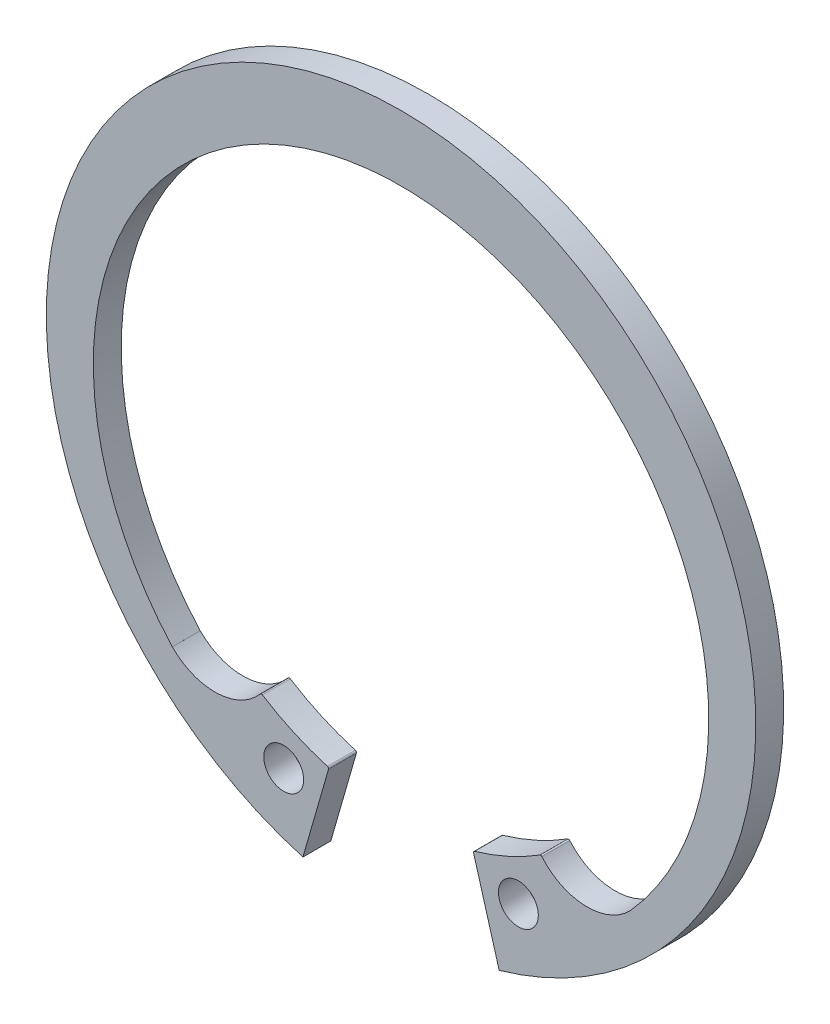
ISO-10303-21;
HEADER;
FILE_DESCRIPTION(('STEP AP214'),'2;1');
FILE_NAME('part.step','',(''),(''),'','','');
FILE_SCHEMA(('AUTOMOTIVE_DESIGN { 1 0 10303 214 1 1 1 1 }'));
ENDSEC;
DATA;
#1=APPLICATION_CONTEXT('core data for automotive mechanical design processes');
#2=APPLICATION_PROTOCOL_DEFINITION('international standard','automotive_design',2000,#1);
#3=PRODUCT_CONTEXT('',#1,'mechanical');
#4=PRODUCT('Part','Part','',(#3));
#5=PRODUCT_RELATED_PRODUCT_CATEGORY('part','',(#4));
#6=PRODUCT_DEFINITION_FORMATION('','',#4);
#7=PRODUCT_DEFINITION_CONTEXT('part definition',#1,'design');
#8=PRODUCT_DEFINITION('design','',#6,#7);
#9=PRODUCT_DEFINITION_SHAPE('','',#8);
#10=(LENGTH_UNIT() NAMED_UNIT(*) SI_UNIT(.MILLI.,.METRE.));
#11=(NAMED_UNIT(*) PLANE_ANGLE_UNIT() SI_UNIT($,.RADIAN.));
#12=(NAMED_UNIT(*) SI_UNIT($,.STERADIAN.) SOLID_ANGLE_UNIT());
#13=UNCERTAINTY_MEASURE_WITH_UNIT(LENGTH_MEASURE(1.E-05),#10,'distance_accuracy_value','');
#14=(GEOMETRIC_REPRESENTATION_CONTEXT(3) GLOBAL_UNCERTAINTY_ASSIGNED_CONTEXT((#13)) GLOBAL_UNIT_ASSIGNED_CONTEXT((#10,
#11,#12)) REPRESENTATION_CONTEXT('',''));
#15=CARTESIAN_POINT('',(0.,0.,0.));
#16=DIRECTION('',(0.,0.,1.));
#17=DIRECTION('',(1.,0.,0.));
#18=AXIS2_PLACEMENT_3D('',#15,#16,#17);
#19=CARTESIAN_POINT('',(0.,0.,-1.75));
#20=DIRECTION('',(0.,0.,1.));
#21=DIRECTION('',(1.,0.,0.));
#22=AXIS2_PLACEMENT_3D('',#19,#20,#21);
#23=CYLINDRICAL_SURFACE('',#22,22.25);
#24=CARTESIAN_POINT('',(0.,0.,-1.75));
#25=DIRECTION('',(0.,0.,1.));
#26=DIRECTION('',(1.,0.,0.));
#27=AXIS2_PLACEMENT_3D('',#24,#25,#26);
#28=CIRCLE('',#27,22.25);
#29=CARTESIAN_POINT('',(6.15473831044329,-21.3818076020238,-1.75));
#30=VERTEX_POINT('',#29);
#31=CARTESIAN_POINT('',(-6.15473831044329,-21.3818076020238,-1.75));
#32=VERTEX_POINT('',#31);
#33=EDGE_CURVE('E147',#30,#32,#28,.T.);
#34=ORIENTED_EDGE('',*,*,#33,.T.);
#35=DIRECTION('',(0.,0.,1.));
#36=VECTOR('',#35,1.);
#37=CARTESIAN_POINT('',(-6.15473831044329,-21.3818076020238,-1.75));
#38=LINE('',#37,#36);
#39=CARTESIAN_POINT('',(-6.15473831044329,-21.3818076020238,0.));
#40=VERTEX_POINT('',#39);
#41=EDGE_CURVE('E37',#32,#40,#38,.T.);
#42=ORIENTED_EDGE('',*,*,#41,.T.);
#43=CARTESIAN_POINT('',(0.,0.,0.));
#44=DIRECTION('',(0.,0.,1.));
#45=DIRECTION('',(1.,0.,0.));
#46=AXIS2_PLACEMENT_3D('',#43,#44,#45);
#47=CIRCLE('',#46,22.25);
#48=CARTESIAN_POINT('',(6.15473831044329,-21.3818076020238,0.));
#49=VERTEX_POINT('',#48);
#50=EDGE_CURVE('E58',#49,#40,#47,.T.);
#51=ORIENTED_EDGE('',*,*,#50,.F.);
#52=DIRECTION('',(0.,0.,1.));
#53=VECTOR('',#52,1.);
#54=CARTESIAN_POINT('',(6.15473831044329,-21.3818076020238,-1.75));
#55=LINE('',#54,#53);
#56=EDGE_CURVE('E11',#30,#49,#55,.T.);
#57=ORIENTED_EDGE('',*,*,#56,.F.);
#58=EDGE_LOOP('',(#34,#42,#51,#57));
#59=FACE_BOUND('',#58,.T.);
#60=ADVANCED_FACE('F34',(#59),#23,.T.);
#61=CARTESIAN_POINT('',(6.15473831044329,-21.3818076020238,-1.75));
#62=DIRECTION('',(-0.960980116944889,-0.276617452154753,0.));
#63=DIRECTION('',(0.276617452154753,-0.960980116944889,0.));
#64=AXIS2_PLACEMENT_3D('',#61,#62,#63);
#65=PLANE('',#64);
#66=DIRECTION('',(0.276617452154753,-0.960980116944889,0.));
#67=VECTOR('',#66,1.);
#68=CARTESIAN_POINT('',(6.15473831044329,-21.3818076020238,0.));
#69=LINE('',#68,#67);
#70=CARTESIAN_POINT('',(4.55027300891599,-15.8078308298239,0.));
#71=VERTEX_POINT('',#70);
#72=EDGE_CURVE('E250',#71,#49,#69,.T.);
#73=ORIENTED_EDGE('',*,*,#72,.F.);
#74=DIRECTION('',(0.,0.,1.));
#75=VECTOR('',#74,1.);
#76=CARTESIAN_POINT('',(4.55027300891599,-15.8078308298239,-1.75));
#77=LINE('',#76,#75);
#78=CARTESIAN_POINT('',(4.55027300891599,-15.8078308298239,-1.75));
#79=VERTEX_POINT('',#78);
#80=EDGE_CURVE('E223',#79,#71,#77,.T.);
#81=ORIENTED_EDGE('',*,*,#80,.F.);
#82=DIRECTION('',(0.276617452154753,-0.960980116944889,0.));
#83=VECTOR('',#82,1.);
#84=CARTESIAN_POINT('',(6.15473831044329,-21.3818076020238,-1.75));
#85=LINE('',#84,#83);
#86=EDGE_CURVE('E253',#79,#30,#85,.T.);
#87=ORIENTED_EDGE('',*,*,#86,.T.);
#88=ORIENTED_EDGE('',*,*,#56,.T.);
#89=EDGE_LOOP('',(#73,#81,#87,#88));
#90=FACE_BOUND('',#89,.T.);
#91=ADVANCED_FACE('F266',(#90),#65,.T.);
#92=CARTESIAN_POINT('',(0.,-1.15100936737794,-1.75));
#93=DIRECTION('',(0.,0.,1.));
#94=DIRECTION('',(1.,0.,0.));
#95=AXIS2_PLACEMENT_3D('',#92,#93,#94);
#96=CYLINDRICAL_SURFACE('',#95,19.3010093673779);
#97=DIRECTION('',(0.,0.,1.));
#98=VECTOR('',#97,1.);
#99=CARTESIAN_POINT('',(-14.348142605322,-14.0606866048984,-1.75));
#100=LINE('',#99,#98);
#101=CARTESIAN_POINT('',(-14.348142605322,-14.0606866048984,-1.75));
#102=VERTEX_POINT('',#101);
#103=CARTESIAN_POINT('',(-14.348142605322,-14.0606866048984,0.));
#104=VERTEX_POINT('',#103);
#105=EDGE_CURVE('E188',#102,#104,#100,.T.);
#106=ORIENTED_EDGE('',*,*,#105,.F.);
#107=CARTESIAN_POINT('',(0.,-1.15100936737794,-1.75));
#108=DIRECTION('',(0.,0.,-1.));
#109=DIRECTION('',(1.,0.,0.));
#110=AXIS2_PLACEMENT_3D('',#107,#108,#109);
#111=CIRCLE('',#110,19.3010093673779);
#112=CARTESIAN_POINT('',(14.348142605322,-14.0606866048984,-1.75));
#113=VERTEX_POINT('',#112);
#114=EDGE_CURVE('E66',#102,#113,#111,.T.);
#115=ORIENTED_EDGE('',*,*,#114,.T.);
#116=DIRECTION('',(0.,0.,1.));
#117=VECTOR('',#116,1.);
#118=CARTESIAN_POINT('',(14.348142605322,-14.0606866048984,-1.75));
#119=LINE('',#118,#117);
#120=CARTESIAN_POINT('',(14.348142605322,-14.0606866048984,0.));
#121=VERTEX_POINT('',#120);
#122=EDGE_CURVE('E226',#121,#113,#119,.F.);
#123=ORIENTED_EDGE('',*,*,#122,.F.);
#124=CARTESIAN_POINT('',(0.,-1.15100936737794,0.));
#125=DIRECTION('',(0.,0.,-1.));
#126=DIRECTION('',(1.,0.,0.));
#127=AXIS2_PLACEMENT_3D('',#124,#125,#126);
#128=CIRCLE('',#127,19.3010093673779);
#129=EDGE_CURVE('E259',#104,#121,#128,.T.);
#130=ORIENTED_EDGE('',*,*,#129,.F.);
#131=EDGE_LOOP('',(#106,#115,#123,#130));
#132=FACE_BOUND('',#131,.T.);
#133=ADVANCED_FACE('F288',(#132),#96,.F.);
#134=CARTESIAN_POINT('',(-6.15473831044329,-21.3818076020238,-1.75));
#135=DIRECTION('',(0.960980116944889,-0.276617452154754,0.));
#136=DIRECTION('',(0.276617452154754,0.960980116944889,0.));
#137=AXIS2_PLACEMENT_3D('',#134,#135,#136);
#138=PLANE('',#137);
#139=DIRECTION('',(0.276617452154754,0.960980116944889,0.));
#140=VECTOR('',#139,1.);
#141=CARTESIAN_POINT('',(-6.15473831044329,-21.3818076020238,0.));
#142=LINE('',#141,#140);
#143=CARTESIAN_POINT('',(-4.55027300891599,-15.8078308298239,0.));
#144=VERTEX_POINT('',#143);
#145=EDGE_CURVE('E257',#40,#144,#142,.T.);
#146=ORIENTED_EDGE('',*,*,#145,.F.);
#147=ORIENTED_EDGE('',*,*,#41,.F.);
#148=DIRECTION('',(0.276617452154754,0.960980116944889,0.));
#149=VECTOR('',#148,1.);
#150=CARTESIAN_POINT('',(-6.15473831044329,-21.3818076020238,-1.75));
#151=LINE('',#150,#149);
#152=CARTESIAN_POINT('',(-4.55027300891599,-15.8078308298239,-1.75));
#153=VERTEX_POINT('',#152);
#154=EDGE_CURVE('E139',#32,#153,#151,.T.);
#155=ORIENTED_EDGE('',*,*,#154,.T.);
#156=DIRECTION('',(0.,0.,1.));
#157=VECTOR('',#156,1.);
#158=CARTESIAN_POINT('',(-4.55027300891599,-15.8078308298239,-1.75));
#159=LINE('',#158,#157);
#160=EDGE_CURVE('E143',#153,#144,#159,.T.);
#161=ORIENTED_EDGE('',*,*,#160,.T.);
#162=EDGE_LOOP('',(#146,#147,#155,#161));
#163=FACE_BOUND('',#162,.T.);
#164=ADVANCED_FACE('F142',(#163),#138,.T.);
#165=CARTESIAN_POINT('',(0.,0.,-1.75));
#166=DIRECTION('',(0.,0.,1.));
#167=DIRECTION('',(1.,0.,0.));
#168=AXIS2_PLACEMENT_3D('',#165,#166,#167);
#169=PLANE('',#168);
#170=ORIENTED_EDGE('',*,*,#114,.F.);
#171=DIRECTION('',(-0.714225110552972,-0.699916060292657,0.));
#172=VECTOR('',#171,1.);
#173=CARTESIAN_POINT('',(-15.8915087098036,-15.5731323415116,-1.75));
#174=LINE('',#173,#172);
#175=CARTESIAN_POINT('',(-14.3451372472455,-14.057741457278,-1.75));
#176=VERTEX_POINT('',#175);
#177=EDGE_CURVE('E157',#176,#102,#174,.T.);
#178=ORIENTED_EDGE('',*,*,#177,.F.);
#179=CARTESIAN_POINT('',(-11.6775805575411,-11.4436275857849,-1.75));
#180=DIRECTION('',(0.,0.,-1.));
#181=DIRECTION('',(1.,0.,0.));
#182=AXIS2_PLACEMENT_3D('',#179,#180,#181);
#183=CIRCLE('',#182,3.73489625370228);
#184=CARTESIAN_POINT('',(-8.83127616096118,-13.8618916962429,-1.75));
#185=VERTEX_POINT('',#184);
#186=EDGE_CURVE('E174',#185,#176,#183,.T.);
#187=ORIENTED_EDGE('',*,*,#186,.F.);
#188=CARTESIAN_POINT('',(-8.75506776845875,-13.9266395217832,-1.75));
#189=DIRECTION('',(0.,0.,1.));
#190=DIRECTION('',(1.,0.,0.));
#191=AXIS2_PLACEMENT_3D('',#188,#189,#190);
#192=CIRCLE('',#191,0.0999999999999999);
#193=CARTESIAN_POINT('',(-8.70184547199396,-13.8419790991584,-1.75));
#194=VERTEX_POINT('',#193);
#195=EDGE_CURVE('E166',#194,#185,#192,.T.);
#196=ORIENTED_EDGE('',*,*,#195,.F.);
#197=CARTESIAN_POINT('',(0.,0.,-1.75));
#198=DIRECTION('',(0.,0.,-1.));
#199=DIRECTION('',(1.,0.,0.));
#200=AXIS2_PLACEMENT_3D('',#197,#198,#199);
#201=CIRCLE('',#200,16.35);
#202=CARTESIAN_POINT('',(-4.61812560407182,-15.6842410050667,-1.75));
#203=VERTEX_POINT('',#202);
#204=EDGE_CURVE('E162',#203,#194,#201,.T.);
#205=ORIENTED_EDGE('',*,*,#204,.F.);
#206=CARTESIAN_POINT('',(-4.64637102061048,-15.7801690846084,-1.75));
#207=DIRECTION('',(0.,0.,1.));
#208=DIRECTION('',(-1.,0.,0.));
#209=AXIS2_PLACEMENT_3D('',#206,#207,#208);
#210=CIRCLE('',#209,0.0999999999999955);
#211=EDGE_CURVE('E153',#153,#203,#210,.T.);
#212=ORIENTED_EDGE('',*,*,#211,.F.);
#213=ORIENTED_EDGE('',*,*,#154,.F.);
#214=ORIENTED_EDGE('',*,*,#33,.F.);
#215=ORIENTED_EDGE('',*,*,#86,.F.);
#216=CARTESIAN_POINT('',(4.64637102061048,-15.7801690846084,-1.75));
#217=DIRECTION('',(0.,0.,1.));
#218=DIRECTION('',(1.,0.,0.));
#219=AXIS2_PLACEMENT_3D('',#216,#217,#218);
#220=CIRCLE('',#219,0.0999999999999972);
#221=CARTESIAN_POINT('',(4.61812560407182,-15.6842410050667,-1.75));
#222=VERTEX_POINT('',#221);
#223=EDGE_CURVE('E208',#222,#79,#220,.T.);
#224=ORIENTED_EDGE('',*,*,#223,.F.);
#225=CARTESIAN_POINT('',(0.,0.,-1.75));
#226=DIRECTION('',(0.,0.,-1.));
#227=DIRECTION('',(1.,0.,0.));
#228=AXIS2_PLACEMENT_3D('',#225,#226,#227);
#229=CIRCLE('',#228,16.35);
#230=CARTESIAN_POINT('',(8.70184547199396,-13.8419790991584,-1.75));
#231=VERTEX_POINT('',#230);
#232=EDGE_CURVE('E206',#231,#222,#229,.T.);
#233=ORIENTED_EDGE('',*,*,#232,.F.);
#234=CARTESIAN_POINT('',(8.75506776845875,-13.9266395217832,-1.75));
#235=DIRECTION('',(0.,0.,1.));
#236=DIRECTION('',(-1.,0.,0.));
#237=AXIS2_PLACEMENT_3D('',#234,#235,#236);
#238=CIRCLE('',#237,0.0999999999999999);
#239=CARTESIAN_POINT('',(8.83127616096118,-13.8618916962429,-1.75));
#240=VERTEX_POINT('',#239);
#241=EDGE_CURVE('E203',#240,#231,#238,.T.);
#242=ORIENTED_EDGE('',*,*,#241,.F.);
#243=CARTESIAN_POINT('',(11.6775805575411,-11.4436275857849,-1.75));
#244=DIRECTION('',(0.,0.,-1.));
#245=DIRECTION('',(1.,0.,0.));
#246=AXIS2_PLACEMENT_3D('',#243,#244,#245);
#247=CIRCLE('',#246,3.73489625370228);
#248=CARTESIAN_POINT('',(14.3451372472455,-14.057741457278,-1.75));
#249=VERTEX_POINT('',#248);
#250=EDGE_CURVE('E199',#249,#240,#247,.T.);
#251=ORIENTED_EDGE('',*,*,#250,.F.);
#252=DIRECTION('',(-0.714225110552972,0.699916060292657,0.));
#253=VECTOR('',#252,1.);
#254=CARTESIAN_POINT('',(14.3451372472455,-14.057741457278,-1.75));
#255=LINE('',#254,#253);
#256=EDGE_CURVE('E197',#113,#249,#255,.T.);
#257=ORIENTED_EDGE('',*,*,#256,.F.);
#258=EDGE_LOOP('',(#170,#178,#187,#196,#205,#212,#213,#214,#215,#224,#233,#242,#251,#257));
#259=FACE_BOUND('',#258,.T.);
#260=CARTESIAN_POINT('',(7.35991880160462,-17.163543347275,-1.75));
#261=DIRECTION('',(0.,0.,1.));
#262=DIRECTION('',(1.,0.,0.));
#263=AXIS2_PLACEMENT_3D('',#260,#261,#262);
#264=CIRCLE('',#263,1.25);
#265=CARTESIAN_POINT('',(8.60991880160462,-17.163543347275,-1.75));
#266=VERTEX_POINT('',#265);
#267=EDGE_CURVE('E245',#266,#266,#264,.T.);
#268=ORIENTED_EDGE('',*,*,#267,.T.);
#269=EDGE_LOOP('',(#268));
#270=FACE_BOUND('',#269,.T.);
#271=CARTESIAN_POINT('',(-7.35991880160461,-17.163543347275,-1.75));
#272=DIRECTION('',(0.,0.,1.));
#273=DIRECTION('',(1.,0.,0.));
#274=AXIS2_PLACEMENT_3D('',#271,#272,#273);
#275=CIRCLE('',#274,1.25);
#276=CARTESIAN_POINT('',(-6.10991880160461,-17.163543347275,-1.75));
#277=VERTEX_POINT('',#276);
#278=EDGE_CURVE('E239',#277,#277,#275,.T.);
#279=ORIENTED_EDGE('',*,*,#278,.T.);
#280=EDGE_LOOP('',(#279));
#281=FACE_BOUND('',#280,.T.);
#282=ADVANCED_FACE('F159',(#259,#270,#281),#169,.F.);
#283=CARTESIAN_POINT('',(0.,0.,0.));
#284=DIRECTION('',(0.,0.,1.));
#285=DIRECTION('',(1.,0.,0.));
#286=AXIS2_PLACEMENT_3D('',#283,#284,#285);
#287=PLANE('',#286);
#288=DIRECTION('',(-0.714225110552972,-0.699916060292657,0.));
#289=VECTOR('',#288,1.);
#290=CARTESIAN_POINT('',(-15.8915087098036,-15.5731323415116,0.));
#291=LINE('',#290,#289);
#292=CARTESIAN_POINT('',(-14.3451372472455,-14.057741457278,0.));
#293=VERTEX_POINT('',#292);
#294=EDGE_CURVE('E164',#293,#104,#291,.T.);
#295=ORIENTED_EDGE('',*,*,#294,.T.);
#296=ORIENTED_EDGE('',*,*,#129,.T.);
#297=DIRECTION('',(-0.714225110552972,0.699916060292657,0.));
#298=VECTOR('',#297,1.);
#299=CARTESIAN_POINT('',(14.3451372472455,-14.057741457278,0.));
#300=LINE('',#299,#298);
#301=CARTESIAN_POINT('',(14.3451372472455,-14.057741457278,0.));
#302=VERTEX_POINT('',#301);
#303=EDGE_CURVE('E196',#121,#302,#300,.T.);
#304=ORIENTED_EDGE('',*,*,#303,.T.);
#305=CARTESIAN_POINT('',(11.6775805575411,-11.4436275857849,0.));
#306=DIRECTION('',(0.,0.,-1.));
#307=DIRECTION('',(1.,0.,0.));
#308=AXIS2_PLACEMENT_3D('',#305,#306,#307);
#309=CIRCLE('',#308,3.73489625370228);
#310=CARTESIAN_POINT('',(8.83127616096118,-13.8618916962429,0.));
#311=VERTEX_POINT('',#310);
#312=EDGE_CURVE('E213',#302,#311,#309,.T.);
#313=ORIENTED_EDGE('',*,*,#312,.T.);
#314=CARTESIAN_POINT('',(8.75506776845875,-13.9266395217832,0.));
#315=DIRECTION('',(0.,0.,1.));
#316=DIRECTION('',(-1.,0.,0.));
#317=AXIS2_PLACEMENT_3D('',#314,#315,#316);
#318=CIRCLE('',#317,0.0999999999999999);
#319=CARTESIAN_POINT('',(8.70184547199396,-13.8419790991584,0.));
#320=VERTEX_POINT('',#319);
#321=EDGE_CURVE('E216',#311,#320,#318,.T.);
#322=ORIENTED_EDGE('',*,*,#321,.T.);
#323=CARTESIAN_POINT('',(0.,0.,0.));
#324=DIRECTION('',(0.,0.,-1.));
#325=DIRECTION('',(1.,0.,0.));
#326=AXIS2_PLACEMENT_3D('',#323,#324,#325);
#327=CIRCLE('',#326,16.35);
#328=CARTESIAN_POINT('',(4.61812560407182,-15.6842410050667,0.));
#329=VERTEX_POINT('',#328);
#330=EDGE_CURVE('E219',#320,#329,#327,.T.);
#331=ORIENTED_EDGE('',*,*,#330,.T.);
#332=CARTESIAN_POINT('',(4.64637102061048,-15.7801690846084,0.));
#333=DIRECTION('',(0.,0.,1.));
#334=DIRECTION('',(1.,0.,0.));
#335=AXIS2_PLACEMENT_3D('',#332,#333,#334);
#336=CIRCLE('',#335,0.0999999999999972);
#337=EDGE_CURVE('E200',#329,#71,#336,.T.);
#338=ORIENTED_EDGE('',*,*,#337,.T.);
#339=ORIENTED_EDGE('',*,*,#72,.T.);
#340=ORIENTED_EDGE('',*,*,#50,.T.);
#341=ORIENTED_EDGE('',*,*,#145,.T.);
#342=CARTESIAN_POINT('',(-4.64637102061048,-15.7801690846084,0.));
#343=DIRECTION('',(0.,0.,1.));
#344=DIRECTION('',(-1.,0.,0.));
#345=AXIS2_PLACEMENT_3D('',#342,#343,#344);
#346=CIRCLE('',#345,0.0999999999999955);
#347=CARTESIAN_POINT('',(-4.61812560407182,-15.6842410050667,0.));
#348=VERTEX_POINT('',#347);
#349=EDGE_CURVE('E155',#144,#348,#346,.T.);
#350=ORIENTED_EDGE('',*,*,#349,.T.);
#351=CARTESIAN_POINT('',(0.,0.,0.));
#352=DIRECTION('',(0.,0.,-1.));
#353=DIRECTION('',(1.,0.,0.));
#354=AXIS2_PLACEMENT_3D('',#351,#352,#353);
#355=CIRCLE('',#354,16.35);
#356=CARTESIAN_POINT('',(-8.70184547199396,-13.8419790991584,0.));
#357=VERTEX_POINT('',#356);
#358=EDGE_CURVE('E179',#348,#357,#355,.T.);
#359=ORIENTED_EDGE('',*,*,#358,.T.);
#360=CARTESIAN_POINT('',(-8.75506776845875,-13.9266395217832,0.));
#361=DIRECTION('',(0.,0.,1.));
#362=DIRECTION('',(1.,0.,0.));
#363=AXIS2_PLACEMENT_3D('',#360,#361,#362);
#364=CIRCLE('',#363,0.0999999999999999);
#365=CARTESIAN_POINT('',(-8.83127616096118,-13.8618916962429,0.));
#366=VERTEX_POINT('',#365);
#367=EDGE_CURVE('E181',#357,#366,#364,.T.);
#368=ORIENTED_EDGE('',*,*,#367,.T.);
#369=CARTESIAN_POINT('',(-11.6775805575411,-11.4436275857849,0.));
#370=DIRECTION('',(0.,0.,-1.));
#371=DIRECTION('',(1.,0.,0.));
#372=AXIS2_PLACEMENT_3D('',#369,#370,#371);
#373=CIRCLE('',#372,3.73489625370228);
#374=EDGE_CURVE('E169',#366,#293,#373,.T.);
#375=ORIENTED_EDGE('',*,*,#374,.T.);
#376=EDGE_LOOP('',(#295,#296,#304,#313,#322,#331,#338,#339,#340,#341,#350,#359,#368,#375));
#377=FACE_BOUND('',#376,.T.);
#378=CARTESIAN_POINT('',(7.35991880160462,-17.163543347275,0.));
#379=DIRECTION('',(0.,0.,1.));
#380=DIRECTION('',(1.,0.,0.));
#381=AXIS2_PLACEMENT_3D('',#378,#379,#380);
#382=CIRCLE('',#381,1.25);
#383=CARTESIAN_POINT('',(8.60991880160462,-17.163543347275,0.));
#384=VERTEX_POINT('',#383);
#385=EDGE_CURVE('E242',#384,#384,#382,.T.);
#386=ORIENTED_EDGE('',*,*,#385,.F.);
#387=EDGE_LOOP('',(#386));
#388=FACE_BOUND('',#387,.T.);
#389=CARTESIAN_POINT('',(-7.35991880160461,-17.163543347275,0.));
#390=DIRECTION('',(0.,0.,1.));
#391=DIRECTION('',(1.,0.,0.));
#392=AXIS2_PLACEMENT_3D('',#389,#390,#391);
#393=CIRCLE('',#392,1.25);
#394=CARTESIAN_POINT('',(-6.10991880160461,-17.163543347275,0.));
#395=VERTEX_POINT('',#394);
#396=EDGE_CURVE('E238',#395,#395,#393,.T.);
#397=ORIENTED_EDGE('',*,*,#396,.F.);
#398=EDGE_LOOP('',(#397));
#399=FACE_BOUND('',#398,.T.);
#400=ADVANCED_FACE('F261',(#377,#388,#399),#287,.T.);
#401=CARTESIAN_POINT('',(7.35991880160462,-17.163543347275,-1.75));
#402=DIRECTION('',(0.,0.,1.));
#403=DIRECTION('',(1.,0.,0.));
#404=AXIS2_PLACEMENT_3D('',#401,#402,#403);
#405=CYLINDRICAL_SURFACE('',#404,1.25);
#406=ORIENTED_EDGE('',*,*,#267,.F.);
#407=EDGE_LOOP('',(#406));
#408=FACE_BOUND('',#407,.T.);
#409=ORIENTED_EDGE('',*,*,#385,.T.);
#410=EDGE_LOOP('',(#409));
#411=FACE_BOUND('',#410,.T.);
#412=ADVANCED_FACE('F311',(#408,#411),#405,.F.);
#413=CARTESIAN_POINT('',(-7.35991880160461,-17.163543347275,-1.75));
#414=DIRECTION('',(0.,0.,1.));
#415=DIRECTION('',(1.,0.,0.));
#416=AXIS2_PLACEMENT_3D('',#413,#414,#415);
#417=CYLINDRICAL_SURFACE('',#416,1.25);
#418=ORIENTED_EDGE('',*,*,#278,.F.);
#419=EDGE_LOOP('',(#418));
#420=FACE_BOUND('',#419,.T.);
#421=ORIENTED_EDGE('',*,*,#396,.T.);
#422=EDGE_LOOP('',(#421));
#423=FACE_BOUND('',#422,.T.);
#424=ADVANCED_FACE('F304',(#420,#423),#417,.F.);
#425=CARTESIAN_POINT('',(0.,0.,-1.75));
#426=DIRECTION('',(0.,0.,1.));
#427=DIRECTION('',(1.,0.,0.));
#428=AXIS2_PLACEMENT_3D('',#425,#426,#427);
#429=CYLINDRICAL_SURFACE('',#428,16.35);
#430=ORIENTED_EDGE('',*,*,#330,.F.);
#431=DIRECTION('',(0.,0.,1.));
#432=VECTOR('',#431,1.);
#433=CARTESIAN_POINT('',(8.70184547199396,-13.8419790991584,-1.75));
#434=LINE('',#433,#432);
#435=EDGE_CURVE('E230',#231,#320,#434,.T.);
#436=ORIENTED_EDGE('',*,*,#435,.F.);
#437=ORIENTED_EDGE('',*,*,#232,.T.);
#438=DIRECTION('',(0.,0.,1.));
#439=VECTOR('',#438,1.);
#440=CARTESIAN_POINT('',(4.61812560407182,-15.6842410050667,-1.75));
#441=LINE('',#440,#439);
#442=EDGE_CURVE('E227',#222,#329,#441,.T.);
#443=ORIENTED_EDGE('',*,*,#442,.T.);
#444=EDGE_LOOP('',(#430,#436,#437,#443));
#445=FACE_BOUND('',#444,.T.);
#446=ADVANCED_FACE('F302',(#445),#429,.F.);
#447=CARTESIAN_POINT('',(4.64637102061048,-15.7801690846084,-1.75));
#448=DIRECTION('',(0.,0.,1.));
#449=DIRECTION('',(1.,0.,0.));
#450=AXIS2_PLACEMENT_3D('',#447,#448,#449);
#451=CYLINDRICAL_SURFACE('',#450,0.0999999999999972);
#452=ORIENTED_EDGE('',*,*,#337,.F.);
#453=ORIENTED_EDGE('',*,*,#442,.F.);
#454=ORIENTED_EDGE('',*,*,#223,.T.);
#455=ORIENTED_EDGE('',*,*,#80,.T.);
#456=EDGE_LOOP('',(#452,#453,#454,#455));
#457=FACE_BOUND('',#456,.T.);
#458=ADVANCED_FACE('F268',(#457),#451,.T.);
#459=CARTESIAN_POINT('',(8.75506776845875,-13.9266395217832,-1.75));
#460=DIRECTION('',(0.,0.,1.));
#461=DIRECTION('',(1.,0.,0.));
#462=AXIS2_PLACEMENT_3D('',#459,#460,#461);
#463=CYLINDRICAL_SURFACE('',#462,0.0999999999999999);
#464=ORIENTED_EDGE('',*,*,#321,.F.);
#465=DIRECTION('',(0.,0.,1.));
#466=VECTOR('',#465,1.);
#467=CARTESIAN_POINT('',(8.83127616096118,-13.8618916962429,-1.75));
#468=LINE('',#467,#466);
#469=EDGE_CURVE('E233',#240,#311,#468,.T.);
#470=ORIENTED_EDGE('',*,*,#469,.F.);
#471=ORIENTED_EDGE('',*,*,#241,.T.);
#472=ORIENTED_EDGE('',*,*,#435,.T.);
#473=EDGE_LOOP('',(#464,#470,#471,#472));
#474=FACE_BOUND('',#473,.T.);
#475=ADVANCED_FACE('F300',(#474),#463,.T.);
#476=CARTESIAN_POINT('',(11.6775805575411,-11.4436275857849,-1.75));
#477=DIRECTION('',(0.,0.,1.));
#478=DIRECTION('',(1.,0.,0.));
#479=AXIS2_PLACEMENT_3D('',#476,#477,#478);
#480=CYLINDRICAL_SURFACE('',#479,3.73489625370228);
#481=ORIENTED_EDGE('',*,*,#312,.F.);
#482=DIRECTION('',(0.,0.,1.));
#483=VECTOR('',#482,1.);
#484=CARTESIAN_POINT('',(14.3451372472455,-14.057741457278,-1.75));
#485=LINE('',#484,#483);
#486=EDGE_CURVE('E211',#249,#302,#485,.T.);
#487=ORIENTED_EDGE('',*,*,#486,.F.);
#488=ORIENTED_EDGE('',*,*,#250,.T.);
#489=ORIENTED_EDGE('',*,*,#469,.T.);
#490=EDGE_LOOP('',(#481,#487,#488,#489));
#491=FACE_BOUND('',#490,.T.);
#492=ADVANCED_FACE('F297',(#491),#480,.F.);
#493=CARTESIAN_POINT('',(14.3451372472455,-14.057741457278,-1.75));
#494=DIRECTION('',(0.699916060292657,0.714225110552972,0.));
#495=DIRECTION('',(-0.714225110552972,0.699916060292657,0.));
#496=AXIS2_PLACEMENT_3D('',#493,#494,#495);
#497=PLANE('',#496);
#498=ORIENTED_EDGE('',*,*,#303,.F.);
#499=ORIENTED_EDGE('',*,*,#122,.T.);
#500=ORIENTED_EDGE('',*,*,#256,.T.);
#501=ORIENTED_EDGE('',*,*,#486,.T.);
#502=EDGE_LOOP('',(#498,#499,#500,#501));
#503=FACE_BOUND('',#502,.T.);
#504=ADVANCED_FACE('F294',(#503),#497,.T.);
#505=CARTESIAN_POINT('',(0.,0.,-1.75));
#506=DIRECTION('',(0.,0.,1.));
#507=DIRECTION('',(1.,0.,0.));
#508=AXIS2_PLACEMENT_3D('',#505,#506,#507);
#509=CYLINDRICAL_SURFACE('',#508,16.35);
#510=ORIENTED_EDGE('',*,*,#358,.F.);
#511=DIRECTION('',(0.,0.,1.));
#512=VECTOR('',#511,1.);
#513=CARTESIAN_POINT('',(-4.61812560407182,-15.6842410050667,-1.75));
#514=LINE('',#513,#512);
#515=EDGE_CURVE('E156',#203,#348,#514,.T.);
#516=ORIENTED_EDGE('',*,*,#515,.F.);
#517=ORIENTED_EDGE('',*,*,#204,.T.);
#518=DIRECTION('',(0.,0.,1.));
#519=VECTOR('',#518,1.);
#520=CARTESIAN_POINT('',(-8.70184547199396,-13.8419790991584,-1.75));
#521=LINE('',#520,#519);
#522=EDGE_CURVE('E191',#194,#357,#521,.T.);
#523=ORIENTED_EDGE('',*,*,#522,.T.);
#524=EDGE_LOOP('',(#510,#516,#517,#523));
#525=FACE_BOUND('',#524,.T.);
#526=ADVANCED_FACE('F276',(#525),#509,.F.);
#527=CARTESIAN_POINT('',(-15.8915087098036,-15.5731323415116,-1.75));
#528=DIRECTION('',(-0.699916060292657,0.714225110552972,0.));
#529=DIRECTION('',(-0.714225110552972,-0.699916060292657,0.));
#530=AXIS2_PLACEMENT_3D('',#527,#528,#529);
#531=PLANE('',#530);
#532=ORIENTED_EDGE('',*,*,#177,.T.);
#533=ORIENTED_EDGE('',*,*,#105,.T.);
#534=ORIENTED_EDGE('',*,*,#294,.F.);
#535=DIRECTION('',(0.,0.,1.));
#536=VECTOR('',#535,1.);
#537=CARTESIAN_POINT('',(-14.3451372472455,-14.057741457278,-1.75));
#538=LINE('',#537,#536);
#539=EDGE_CURVE('E186',#176,#293,#538,.T.);
#540=ORIENTED_EDGE('',*,*,#539,.F.);
#541=EDGE_LOOP('',(#532,#533,#534,#540));
#542=FACE_BOUND('',#541,.T.);
#543=ADVANCED_FACE('F286',(#542),#531,.T.);
#544=CARTESIAN_POINT('',(-11.6775805575411,-11.4436275857849,-1.75));
#545=DIRECTION('',(0.,0.,1.));
#546=DIRECTION('',(1.,0.,0.));
#547=AXIS2_PLACEMENT_3D('',#544,#545,#546);
#548=CYLINDRICAL_SURFACE('',#547,3.73489625370228);
#549=ORIENTED_EDGE('',*,*,#374,.F.);
#550=DIRECTION('',(0.,0.,1.));
#551=VECTOR('',#550,1.);
#552=CARTESIAN_POINT('',(-8.83127616096118,-13.8618916962429,-1.75));
#553=LINE('',#552,#551);
#554=EDGE_CURVE('E189',#185,#366,#553,.T.);
#555=ORIENTED_EDGE('',*,*,#554,.F.);
#556=ORIENTED_EDGE('',*,*,#186,.T.);
#557=ORIENTED_EDGE('',*,*,#539,.T.);
#558=EDGE_LOOP('',(#549,#555,#556,#557));
#559=FACE_BOUND('',#558,.T.);
#560=ADVANCED_FACE('F282',(#559),#548,.F.);
#561=CARTESIAN_POINT('',(-8.75506776845875,-13.9266395217832,-1.75));
#562=DIRECTION('',(0.,0.,1.));
#563=DIRECTION('',(1.,0.,0.));
#564=AXIS2_PLACEMENT_3D('',#561,#562,#563);
#565=CYLINDRICAL_SURFACE('',#564,0.0999999999999999);
#566=ORIENTED_EDGE('',*,*,#367,.F.);
#567=ORIENTED_EDGE('',*,*,#522,.F.);
#568=ORIENTED_EDGE('',*,*,#195,.T.);
#569=ORIENTED_EDGE('',*,*,#554,.T.);
#570=EDGE_LOOP('',(#566,#567,#568,#569));
#571=FACE_BOUND('',#570,.T.);
#572=ADVANCED_FACE('F278',(#571),#565,.T.);
#573=CARTESIAN_POINT('',(-4.64637102061048,-15.7801690846084,-1.75));
#574=DIRECTION('',(0.,0.,1.));
#575=DIRECTION('',(1.,0.,0.));
#576=AXIS2_PLACEMENT_3D('',#573,#574,#575);
#577=CYLINDRICAL_SURFACE('',#576,0.0999999999999955);
#578=ORIENTED_EDGE('',*,*,#349,.F.);
#579=ORIENTED_EDGE('',*,*,#160,.F.);
#580=ORIENTED_EDGE('',*,*,#211,.T.);
#581=ORIENTED_EDGE('',*,*,#515,.T.);
#582=EDGE_LOOP('',(#578,#579,#580,#581));
#583=FACE_BOUND('',#582,.T.);
#584=ADVANCED_FACE('F151',(#583),#577,.T.);
#585=CLOSED_SHELL('',(#60,#91,#133,#164,#282,#400,#412,#424,#446,#458,#475,#492,#504,#526,#543,
#560,#572,#584));
#586=MANIFOLD_SOLID_BREP('B2',#585);
#587=ADVANCED_BREP_SHAPE_REPRESENTATION('',(#18,#586),#14);
#588=SHAPE_DEFINITION_REPRESENTATION(#9,#587);
ENDSEC;
END-ISO-10303-21;
